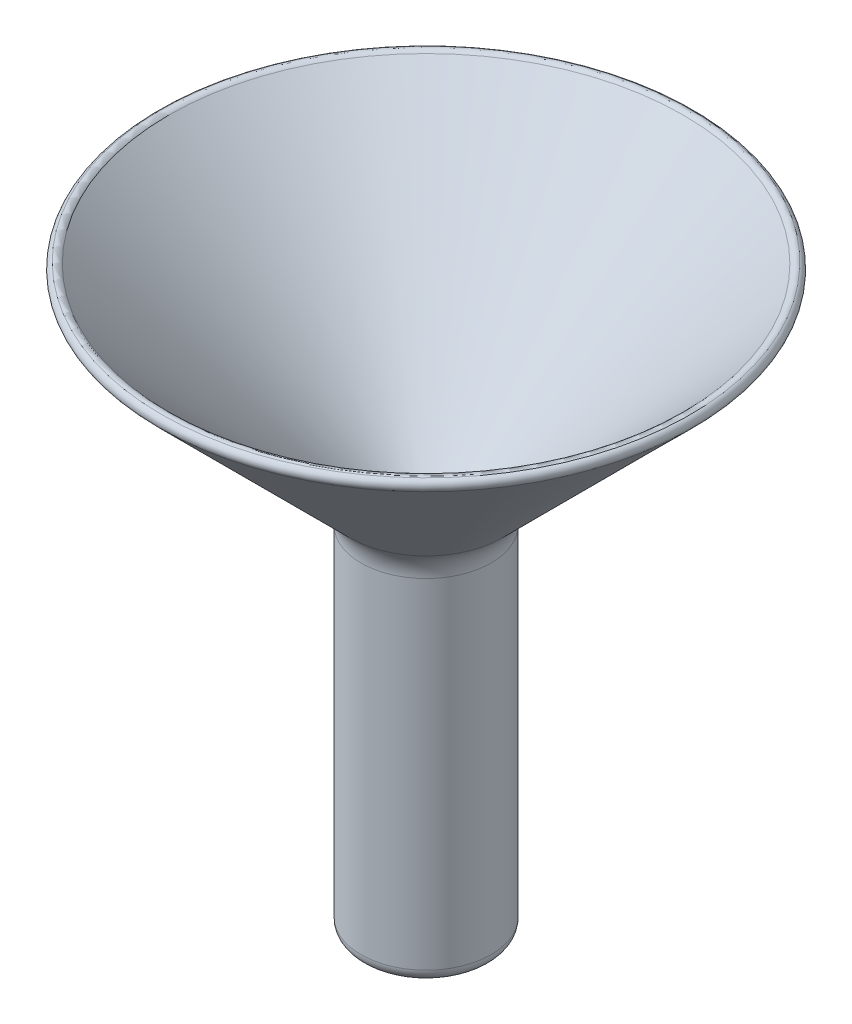
ISO-10303-21;
HEADER;
FILE_DESCRIPTION(('STEP AP214'),'2;1');
FILE_NAME('part.step','',(''),(''),'','','');
FILE_SCHEMA(('AUTOMOTIVE_DESIGN { 1 0 10303 214 1 1 1 1 }'));
ENDSEC;
DATA;
#1=APPLICATION_CONTEXT('core data for automotive mechanical design processes');
#2=APPLICATION_PROTOCOL_DEFINITION('international standard','automotive_design',2000,#1);
#3=PRODUCT_CONTEXT('',#1,'mechanical');
#4=PRODUCT('Part','Part','',(#3));
#5=PRODUCT_RELATED_PRODUCT_CATEGORY('part','',(#4));
#6=PRODUCT_DEFINITION_FORMATION('','',#4);
#7=PRODUCT_DEFINITION_CONTEXT('part definition',#1,'design');
#8=PRODUCT_DEFINITION('design','',#6,#7);
#9=PRODUCT_DEFINITION_SHAPE('','',#8);
#10=(LENGTH_UNIT() NAMED_UNIT(*) SI_UNIT(.MILLI.,.METRE.));
#11=(NAMED_UNIT(*) PLANE_ANGLE_UNIT() SI_UNIT($,.RADIAN.));
#12=(NAMED_UNIT(*) SI_UNIT($,.STERADIAN.) SOLID_ANGLE_UNIT());
#13=UNCERTAINTY_MEASURE_WITH_UNIT(LENGTH_MEASURE(1.E-05),#10,'distance_accuracy_value','');
#14=(GEOMETRIC_REPRESENTATION_CONTEXT(3) GLOBAL_UNCERTAINTY_ASSIGNED_CONTEXT((#13)) GLOBAL_UNIT_ASSIGNED_CONTEXT((#10,
#11,#12)) REPRESENTATION_CONTEXT('',''));
#15=CARTESIAN_POINT('',(0.,0.,0.));
#16=DIRECTION('',(0.,0.,1.));
#17=DIRECTION('',(1.,0.,0.));
#18=AXIS2_PLACEMENT_3D('',#15,#16,#17);
#19=CARTESIAN_POINT('',(0.,0.,0.));
#20=DIRECTION('',(0.,-1.,0.));
#21=DIRECTION('',(0.,0.,-1.));
#22=AXIS2_PLACEMENT_3D('',#19,#20,#21);
#23=CYLINDRICAL_SURFACE('',#22,5.);
#24=CARTESIAN_POINT('',(0.,-11.,0.));
#25=DIRECTION('',(0.,-1.,0.));
#26=DIRECTION('',(0.,0.,-1.));
#27=AXIS2_PLACEMENT_3D('',#24,#25,#26);
#28=CIRCLE('',#27,5.);
#29=CARTESIAN_POINT('',(0.,-11.,-5.));
#30=VERTEX_POINT('',#29);
#31=EDGE_CURVE('E53',#30,#30,#28,.F.);
#32=ORIENTED_EDGE('',*,*,#31,.T.);
#33=EDGE_LOOP('',(#32));
#34=FACE_BOUND('',#33,.T.);
#35=CARTESIAN_POINT('',(0.,15.0573593128807,0.));
#36=DIRECTION('',(0.,-1.,0.));
#37=DIRECTION('',(0.,0.,-1.));
#38=AXIS2_PLACEMENT_3D('',#35,#36,#37);
#39=CIRCLE('',#38,5.);
#40=CARTESIAN_POINT('',(0.,15.0573593128807,-5.));
#41=VERTEX_POINT('',#40);
#42=EDGE_CURVE('E59',#41,#41,#39,.T.);
#43=ORIENTED_EDGE('',*,*,#42,.T.);
#44=EDGE_LOOP('',(#43));
#45=FACE_BOUND('',#44,.T.);
#46=ADVANCED_FACE('F33',(#34,#45),#23,.T.);
#47=CARTESIAN_POINT('',(0.,15.0573593128807,0.));
#48=DIRECTION('',(0.,-1.,0.));
#49=DIRECTION('',(0.,0.,-1.));
#50=AXIS2_PLACEMENT_3D('',#47,#48,#49);
#51=TOROIDAL_SURFACE('',#50,8.,3.);
#52=CARTESIAN_POINT('',(0.,17.1786796564404,0.));
#53=DIRECTION('',(0.,-1.,0.));
#54=DIRECTION('',(0.,0.,-1.));
#55=AXIS2_PLACEMENT_3D('',#52,#53,#54);
#56=CIRCLE('',#55,5.87867965644037);
#57=CARTESIAN_POINT('',(0.,17.1786796564404,5.87867965644037));
#58=VERTEX_POINT('',#57);
#59=EDGE_CURVE('E62',#58,#58,#56,.T.);
#60=ORIENTED_EDGE('',*,*,#59,.T.);
#61=EDGE_LOOP('',(#60));
#62=FACE_BOUND('',#61,.T.);
#63=ORIENTED_EDGE('',*,*,#42,.F.);
#64=EDGE_LOOP('',(#63));
#65=FACE_BOUND('',#64,.T.);
#66=ADVANCED_FACE('F119',(#62,#65),#51,.F.);
#67=CARTESIAN_POINT('',(0.,17.1786796564404,0.));
#68=DIRECTION('',(0.,1.,0.));
#69=DIRECTION('',(0.,0.,1.));
#70=AXIS2_PLACEMENT_3D('',#67,#68,#69);
#71=CONICAL_SURFACE('',#70,5.87867965644037,0.78539816339745);
#72=CARTESIAN_POINT('',(0.,31.7708699582281,0.));
#73=DIRECTION('',(0.,1.,0.));
#74=DIRECTION('',(0.,0.,1.));
#75=AXIS2_PLACEMENT_3D('',#72,#73,#74);
#76=CIRCLE('',#75,20.4708699582282);
#77=CARTESIAN_POINT('',(0.,31.7708699582281,20.4708699582282));
#78=VERTEX_POINT('',#77);
#79=EDGE_CURVE('E41',#78,#78,#76,.F.);
#80=CARTESIAN_POINT('',(0.,31.7708699582281,20.4708699582282));
#81=CARTESIAN_POINT('',(0.,31.6188679759178,20.3188679759179));
#82=CARTESIAN_POINT('',(0.,31.4668659936075,20.1668659936076));
#83=CARTESIAN_POINT('',(0.,31.162862028987,19.862862028987));
#84=CARTESIAN_POINT('',(0.,31.0108600466767,19.7108600466767));
#85=CARTESIAN_POINT('',(0.,30.7068560820561,19.4068560820561));
#86=CARTESIAN_POINT('',(0.,30.5548540997458,19.2548540997459));
#87=CARTESIAN_POINT('',(0.,30.2508501351252,18.9508501351253));
#88=CARTESIAN_POINT('',(0.,30.0988481528149,18.798848152815));
#89=CARTESIAN_POINT('',(0.,29.7948441881944,18.4948441881944));
#90=CARTESIAN_POINT('',(0.,29.6428422058841,18.3428422058841));
#91=CARTESIAN_POINT('',(0.,29.3388382412635,18.0388382412635));
#92=CARTESIAN_POINT('',(0.,29.1868362589532,17.8868362589532));
#93=CARTESIAN_POINT('',(0.,28.8828322943326,17.5828322943327));
#94=CARTESIAN_POINT('',(0.,28.7308303120223,17.4308303120224));
#95=CARTESIAN_POINT('',(0.,28.4268263474018,17.1268263474018));
#96=CARTESIAN_POINT('',(0.,28.2748243650915,16.9748243650915));
#97=CARTESIAN_POINT('',(0.,27.9708204004709,16.6708204004709));
#98=CARTESIAN_POINT('',(0.,27.8188184181606,16.5188184181606));
#99=CARTESIAN_POINT('',(0.,27.51481445354,16.2148144535401));
#100=CARTESIAN_POINT('',(0.,27.3628124712297,16.0628124712298));
#101=CARTESIAN_POINT('',(0.,27.0588085066092,15.7588085066092));
#102=CARTESIAN_POINT('',(0.,26.9068065242989,15.6068065242989));
#103=CARTESIAN_POINT('',(0.,26.6028025596783,15.3028025596783));
#104=CARTESIAN_POINT('',(0.,26.450800577368,15.150800577368));
#105=CARTESIAN_POINT('',(0.,26.1467966127474,14.8467966127475));
#106=CARTESIAN_POINT('',(0.,25.9947946304371,14.6947946304372));
#107=CARTESIAN_POINT('',(0.,25.6907906658166,14.3907906658166));
#108=CARTESIAN_POINT('',(0.,25.5387886835063,14.2387886835063));
#109=CARTESIAN_POINT('',(0.,25.2347847188857,13.9347847188857));
#110=CARTESIAN_POINT('',(0.,25.0827827365754,13.7827827365754));
#111=CARTESIAN_POINT('',(0.,24.7787787719548,13.4787787719548));
#112=CARTESIAN_POINT('',(0.,24.6267767896445,13.3267767896446));
#113=CARTESIAN_POINT('',(0.,24.322772825024,13.022772825024));
#114=CARTESIAN_POINT('',(0.,24.1707708427137,12.8707708427137));
#115=CARTESIAN_POINT('',(0.,23.8667668780931,12.5667668780931));
#116=CARTESIAN_POINT('',(0.,23.7147648957828,12.4147648957828));
#117=CARTESIAN_POINT('',(0.,23.4107609311622,12.1107609311622));
#118=CARTESIAN_POINT('',(0.,23.2587589488519,11.9587589488519));
#119=CARTESIAN_POINT('',(0.,22.9547549842314,11.6547549842314));
#120=CARTESIAN_POINT('',(0.,22.8027530019211,11.5027530019211));
#121=CARTESIAN_POINT('',(0.,22.4987490373005,11.1987490373005));
#122=CARTESIAN_POINT('',(0.,22.3467470549902,11.0467470549902));
#123=CARTESIAN_POINT('',(0.,22.0427430903696,10.7427430903696));
#124=CARTESIAN_POINT('',(0.,21.8907411080593,10.5907411080593));
#125=CARTESIAN_POINT('',(0.,21.5867371434388,10.2867371434388));
#126=CARTESIAN_POINT('',(0.,21.4347351611285,10.1347351611285));
#127=CARTESIAN_POINT('',(0.,21.1307311965079,9.8307311965079));
#128=CARTESIAN_POINT('',(0.,20.9787292141976,9.67872921419761));
#129=CARTESIAN_POINT('',(0.,20.674725249577,9.37472524957703));
#130=CARTESIAN_POINT('',(0.,20.5227232672667,9.22272326726674));
#131=CARTESIAN_POINT('',(0.,20.2187193026462,8.91871930264616));
#132=CARTESIAN_POINT('',(0.,20.0667173203359,8.76671732033587));
#133=CARTESIAN_POINT('',(0.,19.7627133557153,8.46271335571529));
#134=CARTESIAN_POINT('',(0.,19.610711373405,8.310711373405));
#135=CARTESIAN_POINT('',(0.,19.3067074087844,8.00670740878442));
#136=CARTESIAN_POINT('',(0.,19.1547054264741,7.85470542647413));
#137=CARTESIAN_POINT('',(0.,18.8507014618536,7.55070146185355));
#138=CARTESIAN_POINT('',(0.,18.6986994795433,7.39869947954326));
#139=CARTESIAN_POINT('',(0.,18.3946955149227,7.09469551492268));
#140=CARTESIAN_POINT('',(0.,18.2426935326124,6.94269353261239));
#141=CARTESIAN_POINT('',(0.,17.9386895679918,6.63868956799181));
#142=CARTESIAN_POINT('',(0.,17.7866875856815,6.48668758568153));
#143=CARTESIAN_POINT('',(0.,17.482683621061,6.18268362106095));
#144=CARTESIAN_POINT('',(0.,17.3306816387507,6.03068163875066));
#145=CARTESIAN_POINT('',(0.,17.1786796564404,5.87867965644037));
#146=B_SPLINE_CURVE_WITH_KNOTS('',3,(#80,#81,#82,#83,#84,#85,#86,#87,#88,#89,#90,#91,#92,#93,
#94,#95,#96,#97,#98,#99,#100,#101,#102,#103,#104,#105,#106,#107,#108,#109,#110,#111,#112,#113,
#114,#115,#116,#117,#118,#119,#120,#121,#122,#123,#124,#125,#126,#127,#128,#129,#130,#131,#132,
#133,#134,#135,#136,#137,#138,#139,#140,#141,#142,#143,#144,#145),.UNSPECIFIED.,.F.,.F.,(4,2,2,
2,2,2,2,2,2,2,2,2,2,2,2,2,2,2,2,2,2,2,2,2,2,2,2,2,2,2,2,2,4),(0.,0.644889794672421,
1.28977958934484,1.93466938401726,2.57955917868968,3.2244489733621,3.86933876803452,
4.51422856270694,5.15911835737936,5.80400815205178,6.44889794672419,7.09378774139662,
7.73867753606903,8.38356733074146,9.02845712541387,9.67334692008629,10.3182367147587,
10.9631265094311,11.6080163041036,12.252906098776,12.8977958934484,13.5426856881208,
14.1875754827932,14.8324652774656,15.4773550721381,16.1222448668105,16.7671346614829,
17.4120244561553,18.0569142508277,18.7018040455002,19.3466938401726,19.991583634845,
20.6364734295174),.UNSPECIFIED.);
#147=EDGE_CURVE('BSEAM125',#78,#58,#146,.T.);
#148=ORIENTED_EDGE('',*,*,#79,.T.);
#149=ORIENTED_EDGE('',*,*,#59,.F.);
#150=ORIENTED_EDGE('',*,*,#147,.T.);
#151=ORIENTED_EDGE('',*,*,#147,.F.);
#152=EDGE_LOOP('',(#148,#150,#149,#151));
#153=FACE_BOUND('',#152,.T.);
#154=ADVANCED_FACE('F125',(#153),#71,.T.);
#155=CARTESIAN_POINT('',(0.,14.8142135623731,0.));
#156=DIRECTION('',(0.,1.,0.));
#157=DIRECTION('',(0.,0.,1.));
#158=AXIS2_PLACEMENT_3D('',#155,#156,#157);
#159=CONICAL_SURFACE('',#158,2.1,0.78539816339745);
#160=CARTESIAN_POINT('',(0.,32.4779767394147,0.));
#161=DIRECTION('',(0.,-1.,0.));
#162=DIRECTION('',(0.,0.,-1.));
#163=AXIS2_PLACEMENT_3D('',#160,#161,#162);
#164=CIRCLE('',#163,19.7637631770416);
#165=CARTESIAN_POINT('',(0.,32.4779767394147,19.7637631770416));
#166=VERTEX_POINT('',#165);
#167=EDGE_CURVE('E10',#166,#166,#164,.F.);
#168=CARTESIAN_POINT('',(0.,15.1071067811866,0.));
#169=DIRECTION('',(0.,1.,0.));
#170=DIRECTION('',(0.,0.,1.));
#171=AXIS2_PLACEMENT_3D('',#168,#169,#170);
#172=CIRCLE('',#171,2.39289321881345);
#173=CARTESIAN_POINT('',(0.,15.1071067811866,2.39289321881345));
#174=VERTEX_POINT('',#173);
#175=EDGE_CURVE('E50',#174,#174,#172,.F.);
#176=CARTESIAN_POINT('',(0.,32.4779767394147,19.7637631770416));
#177=CARTESIAN_POINT('',(0.,32.2970301773498,19.5828166149768));
#178=CARTESIAN_POINT('',(0.,32.1160836152849,19.4018700529119));
#179=CARTESIAN_POINT('',(0.,31.7541904911552,19.0399769287821));
#180=CARTESIAN_POINT('',(0.,31.5732439290903,18.8590303667173));
#181=CARTESIAN_POINT('',(0.,31.2113508049606,18.4971372425875));
#182=CARTESIAN_POINT('',(0.,31.0304042428957,18.3161906805226));
#183=CARTESIAN_POINT('',(0.,30.6685111187659,17.9542975563929));
#184=CARTESIAN_POINT('',(0.,30.4875645567011,17.773350994328));
#185=CARTESIAN_POINT('',(0.,30.1256714325713,17.4114578701982));
#186=CARTESIAN_POINT('',(0.,29.9447248705064,17.2305113081334));
#187=CARTESIAN_POINT('',(0.,29.5828317463767,16.8686181840036));
#188=CARTESIAN_POINT('',(0.,29.4018851843118,16.6876716219387));
#189=CARTESIAN_POINT('',(0.,29.039992060182,16.325778497809));
#190=CARTESIAN_POINT('',(0.,28.8590454981172,16.1448319357441));
#191=CARTESIAN_POINT('',(0.,28.4971523739874,15.7829388116143));
#192=CARTESIAN_POINT('',(0.,28.3162058119225,15.6019922495495));
#193=CARTESIAN_POINT('',(0.,27.9543126877928,15.2400991254197));
#194=CARTESIAN_POINT('',(0.,27.7733661257279,15.0591525633548));
#195=CARTESIAN_POINT('',(0.,27.4114730015982,14.6972594392251));
#196=CARTESIAN_POINT('',(0.,27.2305264395333,14.5163128771602));
#197=CARTESIAN_POINT('',(0.,26.8686333154035,14.1544197530305));
#198=CARTESIAN_POINT('',(0.,26.6876867533386,13.9734731909656));
#199=CARTESIAN_POINT('',(0.,26.3257936292089,13.6115800668358));
#200=CARTESIAN_POINT('',(0.,26.144847067144,13.4306335047709));
#201=CARTESIAN_POINT('',(0.,25.7829539430143,13.0687403806412));
#202=CARTESIAN_POINT('',(0.,25.6020073809494,12.8877938185763));
#203=CARTESIAN_POINT('',(0.,25.2401142568196,12.5259006944466));
#204=CARTESIAN_POINT('',(0.,25.0591676947548,12.3449541323817));
#205=CARTESIAN_POINT('',(0.,24.697274570625,11.9830610082519));
#206=CARTESIAN_POINT('',(0.,24.5163280085601,11.8021144461871));
#207=CARTESIAN_POINT('',(0.,24.1544348844304,11.4402213220573));
#208=CARTESIAN_POINT('',(0.,23.9734883223655,11.2592747599924));
#209=CARTESIAN_POINT('',(0.,23.6115951982358,10.8973816358627));
#210=CARTESIAN_POINT('',(0.,23.4306486361709,10.7164350737978));
#211=CARTESIAN_POINT('',(0.,23.0687555120411,10.354541949668));
#212=CARTESIAN_POINT('',(0.,22.8878089499762,10.1735953876032));
#213=CARTESIAN_POINT('',(0.,22.5259158258465,9.81170226347341));
#214=CARTESIAN_POINT('',(0.,22.3449692637816,9.63075570140853));
#215=CARTESIAN_POINT('',(0.,21.9830761396519,9.26886257727878));
#216=CARTESIAN_POINT('',(0.,21.802129577587,9.0879160152139));
#217=CARTESIAN_POINT('',(0.,21.4402364534572,8.72602289108415));
#218=CARTESIAN_POINT('',(0.,21.2592898913924,8.54507632901927));
#219=CARTESIAN_POINT('',(0.,20.8973967672626,8.18318320488951));
#220=CARTESIAN_POINT('',(0.,20.7164502051977,8.00223664282464));
#221=CARTESIAN_POINT('',(0.,20.354557081068,7.64034351869489));
#222=CARTESIAN_POINT('',(0.,20.1736105190031,7.45939695663001));
#223=CARTESIAN_POINT('',(0.,19.8117173948733,7.09750383250025));
#224=CARTESIAN_POINT('',(0.,19.6307708328085,6.91655727043538));
#225=CARTESIAN_POINT('',(0.,19.2688777086787,6.55466414630562));
#226=CARTESIAN_POINT('',(0.,19.0879311466138,6.37371758424075));
#227=CARTESIAN_POINT('',(0.,18.7260380224841,6.01182446011099));
#228=CARTESIAN_POINT('',(0.,18.5450914604192,5.83087789804611));
#229=CARTESIAN_POINT('',(0.,18.1831983362895,5.46898477391636));
#230=CARTESIAN_POINT('',(0.,18.0022517742246,5.28803821185148));
#231=CARTESIAN_POINT('',(0.,17.6403586500948,4.92614508772173));
#232=CARTESIAN_POINT('',(0.,17.45941208803,4.74519852565685));
#233=CARTESIAN_POINT('',(0.,17.0975189639002,4.3833054015271));
#234=CARTESIAN_POINT('',(0.,16.9165724018353,4.20235883946222));
#235=CARTESIAN_POINT('',(0.,16.5546792777056,3.84046571533247));
#236=CARTESIAN_POINT('',(0.,16.3737327156407,3.65951915326759));
#237=CARTESIAN_POINT('',(0.,16.0118395915109,3.29762602913783));
#238=CARTESIAN_POINT('',(0.,15.8308930294461,3.11667946707296));
#239=CARTESIAN_POINT('',(0.,15.4689999053163,2.75478634294321));
#240=CARTESIAN_POINT('',(0.,15.2880533432514,2.57383978087833));
#241=CARTESIAN_POINT('',(0.,15.1071067811866,2.39289321881345));
#242=B_SPLINE_CURVE_WITH_KNOTS('',3,(#176,#177,#178,#179,#180,#181,#182,#183,#184,#185,#186,
#187,#188,#189,#190,#191,#192,#193,#194,#195,#196,#197,#198,#199,#200,#201,#202,#203,#204,#205,
#206,#207,#208,#209,#210,#211,#212,#213,#214,#215,#216,#217,#218,#219,#220,#221,#222,#223,#224,
#225,#226,#227,#228,#229,#230,#231,#232,#233,#234,#235,#236,#237,#238,#239,#240,#241),
.UNSPECIFIED.,.F.,.F.,(4,2,2,2,2,2,2,2,2,2,2,2,2,2,2,2,2,2,2,2,2,2,2,2,2,2,2,2,2,2,2,2,4),(0.,
0.767691246410796,1.5353824928216,2.3030737392324,3.0707649856432,3.838456232054,
4.6061474784648,5.3738387248756,6.1415299712864,6.90922121769721,7.67691246410801,
8.44460371051881,9.2122949569296,9.97998620334041,10.7476774497512,11.515368696162,
12.2830599425728,13.0507511889836,13.8184424353944,14.5861336818052,15.353824928216,
16.1215161746268,16.8892074210376,17.6568986674484,18.4245899138592,19.19228116027,
19.9599724066808,20.7276636530916,21.4953548995024,22.2630461459132,23.030737392324,
23.7984286387348,24.5661198851456),.UNSPECIFIED.);
#243=EDGE_CURVE('BSEAM192',#166,#174,#242,.T.);
#244=ORIENTED_EDGE('',*,*,#167,.T.);
#245=ORIENTED_EDGE('',*,*,#175,.T.);
#246=ORIENTED_EDGE('',*,*,#243,.T.);
#247=ORIENTED_EDGE('',*,*,#243,.F.);
#248=EDGE_LOOP('',(#244,#246,#245,#247));
#249=FACE_BOUND('',#248,.T.);
#250=ADVANCED_FACE('F192',(#249),#159,.F.);
#251=CARTESIAN_POINT('',(0.,0.,0.));
#252=DIRECTION('',(0.,-1.,0.));
#253=DIRECTION('',(0.,0.,-1.));
#254=AXIS2_PLACEMENT_3D('',#251,#252,#253);
#255=CYLINDRICAL_SURFACE('',#254,2.1);
#256=CARTESIAN_POINT('',(0.,14.4,0.));
#257=DIRECTION('',(0.,1.,0.));
#258=DIRECTION('',(0.,0.,1.));
#259=AXIS2_PLACEMENT_3D('',#256,#257,#258);
#260=CIRCLE('',#259,2.1);
#261=CARTESIAN_POINT('',(0.,14.4,2.1));
#262=VERTEX_POINT('',#261);
#263=EDGE_CURVE('E45',#262,#262,#260,.T.);
#264=ORIENTED_EDGE('',*,*,#263,.T.);
#265=EDGE_LOOP('',(#264));
#266=FACE_BOUND('',#265,.T.);
#267=CARTESIAN_POINT('',(0.,-5.,0.));
#268=DIRECTION('',(0.,-1.,0.));
#269=DIRECTION('',(0.,0.,-1.));
#270=AXIS2_PLACEMENT_3D('',#267,#268,#269);
#271=CIRCLE('',#270,2.1);
#272=CARTESIAN_POINT('',(0.,-5.,-2.1));
#273=VERTEX_POINT('',#272);
#274=EDGE_CURVE('E65',#273,#273,#271,.T.);
#275=ORIENTED_EDGE('',*,*,#274,.T.);
#276=EDGE_LOOP('',(#275));
#277=FACE_BOUND('',#276,.T.);
#278=ADVANCED_FACE('F188',(#266,#277),#255,.F.);
#279=CARTESIAN_POINT('',(0.,-3.,0.));
#280=DIRECTION('',(0.,-1.,0.));
#281=DIRECTION('',(1.,0.,0.));
#282=AXIS2_PLACEMENT_3D('',#279,#280,#281);
#283=SPHERICAL_SURFACE('',#282,2.9);
#284=ORIENTED_EDGE('',*,*,#274,.F.);
#285=EDGE_LOOP('',(#284));
#286=FACE_BOUND('',#285,.T.);
#287=CARTESIAN_POINT('',(0.,-3.,0.));
#288=DIRECTION('',(0.,-1.,0.));
#289=DIRECTION('',(0.,0.,-1.));
#290=AXIS2_PLACEMENT_3D('',#287,#288,#289);
#291=CIRCLE('',#290,2.9);
#292=CARTESIAN_POINT('',(0.,-3.,-2.9));
#293=VERTEX_POINT('',#292);
#294=EDGE_CURVE('E68',#293,#293,#291,.T.);
#295=ORIENTED_EDGE('',*,*,#294,.T.);
#296=EDGE_LOOP('',(#295));
#297=FACE_BOUND('',#296,.T.);
#298=ADVANCED_FACE('F184',(#286,#297),#283,.T.);
#299=CARTESIAN_POINT('',(0.,0.,0.));
#300=DIRECTION('',(0.,-1.,0.));
#301=DIRECTION('',(0.,0.,-1.));
#302=AXIS2_PLACEMENT_3D('',#299,#300,#301);
#303=CYLINDRICAL_SURFACE('',#302,2.9);
#304=CARTESIAN_POINT('',(0.,5.,0.));
#305=DIRECTION('',(0.,-1.,0.));
#306=DIRECTION('',(0.,0.,-1.));
#307=AXIS2_PLACEMENT_3D('',#304,#305,#306);
#308=CIRCLE('',#307,2.9);
#309=CARTESIAN_POINT('',(0.,5.,-2.9));
#310=VERTEX_POINT('',#309);
#311=EDGE_CURVE('E71',#310,#310,#308,.T.);
#312=ORIENTED_EDGE('',*,*,#311,.T.);
#313=EDGE_LOOP('',(#312));
#314=FACE_BOUND('',#313,.T.);
#315=ORIENTED_EDGE('',*,*,#294,.F.);
#316=EDGE_LOOP('',(#315));
#317=FACE_BOUND('',#316,.T.);
#318=ADVANCED_FACE('F180',(#314,#317),#303,.T.);
#319=CARTESIAN_POINT('',(0.,5.,0.));
#320=DIRECTION('',(0.,-1.,0.));
#321=DIRECTION('',(0.,0.,-1.));
#322=AXIS2_PLACEMENT_3D('',#319,#320,#321);
#323=TOROIDAL_SURFACE('',#322,3.7,0.8);
#324=CARTESIAN_POINT('',(0.,5.04995121951219,0.));
#325=DIRECTION('',(0.,-1.,0.));
#326=DIRECTION('',(0.,0.,-1.));
#327=AXIS2_PLACEMENT_3D('',#324,#325,#326);
#328=CIRCLE('',#327,2.90156097560976);
#329=CARTESIAN_POINT('',(0.,5.04995121951219,-2.90156097560976));
#330=VERTEX_POINT('',#329);
#331=EDGE_CURVE('E74',#330,#330,#328,.T.);
#332=ORIENTED_EDGE('',*,*,#331,.T.);
#333=EDGE_LOOP('',(#332));
#334=FACE_BOUND('',#333,.T.);
#335=ORIENTED_EDGE('',*,*,#311,.F.);
#336=EDGE_LOOP('',(#335));
#337=FACE_BOUND('',#336,.T.);
#338=ADVANCED_FACE('F176',(#334,#337),#323,.F.);
#339=CARTESIAN_POINT('',(0.,11.4,0.));
#340=DIRECTION('',(0.,1.,0.));
#341=DIRECTION('',(0.,0.,1.));
#342=AXIS2_PLACEMENT_3D('',#339,#340,#341);
#343=CONICAL_SURFACE('',#342,3.1,0.0312398334302685);
#344=ORIENTED_EDGE('',*,*,#331,.F.);
#345=EDGE_LOOP('',(#344));
#346=FACE_BOUND('',#345,.T.);
#347=CARTESIAN_POINT('',(0.,11.4,0.));
#348=DIRECTION('',(0.,-1.,0.));
#349=DIRECTION('',(0.,0.,-1.));
#350=AXIS2_PLACEMENT_3D('',#347,#348,#349);
#351=CIRCLE('',#350,3.1);
#352=CARTESIAN_POINT('',(0.,11.4,-3.1));
#353=VERTEX_POINT('',#352);
#354=EDGE_CURVE('E77',#353,#353,#351,.T.);
#355=ORIENTED_EDGE('',*,*,#354,.T.);
#356=EDGE_LOOP('',(#355));
#357=FACE_BOUND('',#356,.T.);
#358=ADVANCED_FACE('F172',(#346,#357),#343,.T.);
#359=CARTESIAN_POINT('',(0.,0.,0.));
#360=DIRECTION('',(0.,-1.,0.));
#361=DIRECTION('',(0.,0.,-1.));
#362=AXIS2_PLACEMENT_3D('',#359,#360,#361);
#363=CYLINDRICAL_SURFACE('',#362,3.1);
#364=ORIENTED_EDGE('',*,*,#354,.F.);
#365=EDGE_LOOP('',(#364));
#366=FACE_BOUND('',#365,.T.);
#367=CARTESIAN_POINT('',(0.,14.4,0.));
#368=DIRECTION('',(0.,-1.,0.));
#369=DIRECTION('',(0.,0.,-1.));
#370=AXIS2_PLACEMENT_3D('',#367,#368,#369);
#371=CIRCLE('',#370,3.09999999999999);
#372=CARTESIAN_POINT('',(0.,14.4,-3.09999999999999));
#373=VERTEX_POINT('',#372);
#374=EDGE_CURVE('E80',#373,#373,#371,.T.);
#375=ORIENTED_EDGE('',*,*,#374,.T.);
#376=EDGE_LOOP('',(#375));
#377=FACE_BOUND('',#376,.T.);
#378=ADVANCED_FACE('F168',(#366,#377),#363,.T.);
#379=CARTESIAN_POINT('',(0.,15.,0.));
#380=DIRECTION('',(0.,1.,0.));
#381=DIRECTION('',(0.,0.,1.));
#382=AXIS2_PLACEMENT_3D('',#379,#380,#381);
#383=CONICAL_SURFACE('',#382,3.7,0.785398163397448);
#384=ORIENTED_EDGE('',*,*,#374,.F.);
#385=EDGE_LOOP('',(#384));
#386=FACE_BOUND('',#385,.T.);
#387=CARTESIAN_POINT('',(0.,15.,0.));
#388=DIRECTION('',(0.,-1.,0.));
#389=DIRECTION('',(0.,0.,-1.));
#390=AXIS2_PLACEMENT_3D('',#387,#388,#389);
#391=CIRCLE('',#390,3.7);
#392=CARTESIAN_POINT('',(0.,15.,-3.7));
#393=VERTEX_POINT('',#392);
#394=EDGE_CURVE('E83',#393,#393,#391,.T.);
#395=ORIENTED_EDGE('',*,*,#394,.T.);
#396=EDGE_LOOP('',(#395));
#397=FACE_BOUND('',#396,.T.);
#398=ADVANCED_FACE('F164',(#386,#397),#383,.T.);
#399=CARTESIAN_POINT('',(0.,0.,0.));
#400=DIRECTION('',(0.,-1.,0.));
#401=DIRECTION('',(0.,0.,-1.));
#402=AXIS2_PLACEMENT_3D('',#399,#400,#401);
#403=CYLINDRICAL_SURFACE('',#402,3.7);
#404=ORIENTED_EDGE('',*,*,#394,.F.);
#405=EDGE_LOOP('',(#404));
#406=FACE_BOUND('',#405,.T.);
#407=CARTESIAN_POINT('',(0.,-2.91485321018865,0.));
#408=DIRECTION('',(0.,-1.,0.));
#409=DIRECTION('',(0.,0.,-1.));
#410=AXIS2_PLACEMENT_3D('',#407,#408,#409);
#411=CIRCLE('',#410,3.7);
#412=CARTESIAN_POINT('',(0.,-2.91485321018865,-3.7));
#413=VERTEX_POINT('',#412);
#414=EDGE_CURVE('E86',#413,#413,#411,.T.);
#415=ORIENTED_EDGE('',*,*,#414,.T.);
#416=EDGE_LOOP('',(#415));
#417=FACE_BOUND('',#416,.T.);
#418=ADVANCED_FACE('F160',(#406,#417),#403,.F.);
#419=CARTESIAN_POINT('',(0.,-2.91485321018866,0.));
#420=DIRECTION('',(0.,-1.,0.));
#421=DIRECTION('',(0.,0.,-1.));
#422=AXIS2_PLACEMENT_3D('',#419,#420,#421);
#423=DEGENERATE_TOROIDAL_SURFACE('',#422,1.3,5.,.F.);
#424=ORIENTED_EDGE('',*,*,#414,.F.);
#425=EDGE_LOOP('',(#424));
#426=FACE_BOUND('',#425,.T.);
#427=CARTESIAN_POINT('',(0.,-4.98752054720073,0.));
#428=DIRECTION('',(0.,-1.,0.));
#429=DIRECTION('',(0.,0.,-1.));
#430=AXIS2_PLACEMENT_3D('',#427,#428,#429);
#431=CIRCLE('',#430,3.25017033857891);
#432=CARTESIAN_POINT('',(0.,-4.98752054720073,-3.25017033857891));
#433=VERTEX_POINT('',#432);
#434=EDGE_CURVE('E89',#433,#433,#431,.T.);
#435=ORIENTED_EDGE('',*,*,#434,.T.);
#436=EDGE_LOOP('',(#435));
#437=FACE_BOUND('',#436,.T.);
#438=ADVANCED_FACE('F156',(#426,#437),#423,.T.);
#439=CARTESIAN_POINT('',(0.,-4.98752054720073,0.));
#440=DIRECTION('',(0.,1.,0.));
#441=DIRECTION('',(0.,0.,1.));
#442=AXIS2_PLACEMENT_3D('',#439,#440,#441);
#443=CONICAL_SURFACE('',#442,3.25017033857891,0.427430089087367);
#444=CARTESIAN_POINT('',(0.,-5.42733266298792,0.));
#445=DIRECTION('',(0.,-1.,0.));
#446=DIRECTION('',(0.,0.,-1.));
#447=AXIS2_PLACEMENT_3D('',#444,#445,#446);
#448=CIRCLE('',#447,3.0498296614211);
#449=CARTESIAN_POINT('',(0.,-5.42733266298792,-3.0498296614211));
#450=VERTEX_POINT('',#449);
#451=EDGE_CURVE('E92',#450,#450,#448,.T.);
#452=ORIENTED_EDGE('',*,*,#451,.T.);
#453=EDGE_LOOP('',(#452));
#454=FACE_BOUND('',#453,.T.);
#455=ORIENTED_EDGE('',*,*,#434,.F.);
#456=EDGE_LOOP('',(#455));
#457=FACE_BOUND('',#456,.T.);
#458=ADVANCED_FACE('F152',(#454,#457),#443,.F.);
#459=CARTESIAN_POINT('',(0.,-7.5,0.));
#460=DIRECTION('',(0.,-1.,0.));
#461=DIRECTION('',(0.,0.,-1.));
#462=AXIS2_PLACEMENT_3D('',#459,#460,#461);
#463=TOROIDAL_SURFACE('',#462,7.6,5.);
#464=ORIENTED_EDGE('',*,*,#451,.F.);
#465=EDGE_LOOP('',(#464));
#466=FACE_BOUND('',#465,.T.);
#467=CARTESIAN_POINT('',(0.,-7.5,0.));
#468=DIRECTION('',(0.,-1.,0.));
#469=DIRECTION('',(0.,0.,-1.));
#470=AXIS2_PLACEMENT_3D('',#467,#468,#469);
#471=CIRCLE('',#470,2.6);
#472=CARTESIAN_POINT('',(0.,-7.5,-2.6));
#473=VERTEX_POINT('',#472);
#474=EDGE_CURVE('E95',#473,#473,#471,.T.);
#475=ORIENTED_EDGE('',*,*,#474,.T.);
#476=EDGE_LOOP('',(#475));
#477=FACE_BOUND('',#476,.T.);
#478=ADVANCED_FACE('F147',(#466,#477),#463,.T.);
#479=CARTESIAN_POINT('',(0.,0.,0.));
#480=DIRECTION('',(0.,-1.,0.));
#481=DIRECTION('',(0.,0.,-1.));
#482=AXIS2_PLACEMENT_3D('',#479,#480,#481);
#483=CYLINDRICAL_SURFACE('',#482,2.6);
#484=CARTESIAN_POINT('',(0.,-12.,0.));
#485=DIRECTION('',(0.,-1.,0.));
#486=DIRECTION('',(0.,0.,-1.));
#487=AXIS2_PLACEMENT_3D('',#484,#485,#486);
#488=CIRCLE('',#487,2.6);
#489=CARTESIAN_POINT('',(0.,-12.,-2.6));
#490=VERTEX_POINT('',#489);
#491=EDGE_CURVE('E98',#490,#490,#488,.T.);
#492=ORIENTED_EDGE('',*,*,#491,.T.);
#493=EDGE_LOOP('',(#492));
#494=FACE_BOUND('',#493,.T.);
#495=ORIENTED_EDGE('',*,*,#474,.F.);
#496=EDGE_LOOP('',(#495));
#497=FACE_BOUND('',#496,.T.);
#498=ADVANCED_FACE('F137',(#494,#497),#483,.F.);
#499=CARTESIAN_POINT('',(0.,-12.,0.));
#500=DIRECTION('',(0.,-1.,0.));
#501=DIRECTION('',(0.,0.,-1.));
#502=AXIS2_PLACEMENT_3D('',#499,#500,#501);
#503=PLANE('',#502);
#504=CARTESIAN_POINT('',(0.,-12.,0.));
#505=DIRECTION('',(0.,-1.,0.));
#506=DIRECTION('',(0.,0.,-1.));
#507=AXIS2_PLACEMENT_3D('',#504,#505,#506);
#508=CIRCLE('',#507,4.);
#509=CARTESIAN_POINT('',(0.,-12.,-4.));
#510=VERTEX_POINT('',#509);
#511=EDGE_CURVE('E56',#510,#510,#508,.T.);
#512=ORIENTED_EDGE('',*,*,#511,.T.);
#513=EDGE_LOOP('',(#512));
#514=FACE_BOUND('',#513,.T.);
#515=ORIENTED_EDGE('',*,*,#491,.F.);
#516=EDGE_LOOP('',(#515));
#517=FACE_BOUND('',#516,.T.);
#518=ADVANCED_FACE('F132',(#514,#517),#503,.T.);
#519=CARTESIAN_POINT('',(0.,-11.,0.));
#520=DIRECTION('',(0.,-1.,0.));
#521=DIRECTION('',(0.,0.,-1.));
#522=AXIS2_PLACEMENT_3D('',#519,#520,#521);
#523=TOROIDAL_SURFACE('',#522,4.,1.);
#524=ORIENTED_EDGE('',*,*,#31,.F.);
#525=EDGE_LOOP('',(#524));
#526=FACE_BOUND('',#525,.T.);
#527=ORIENTED_EDGE('',*,*,#511,.F.);
#528=EDGE_LOOP('',(#527));
#529=FACE_BOUND('',#528,.T.);
#530=ADVANCED_FACE('F115',(#526,#529),#523,.T.);
#531=CARTESIAN_POINT('',(0.,14.4,0.));
#532=DIRECTION('',(0.,1.,0.));
#533=DIRECTION('',(0.,0.,1.));
#534=AXIS2_PLACEMENT_3D('',#531,#532,#533);
#535=TOROIDAL_SURFACE('',#534,3.1,1.);
#536=ORIENTED_EDGE('',*,*,#263,.F.);
#537=EDGE_LOOP('',(#536));
#538=FACE_BOUND('',#537,.T.);
#539=ORIENTED_EDGE('',*,*,#175,.F.);
#540=EDGE_LOOP('',(#539));
#541=FACE_BOUND('',#540,.T.);
#542=ADVANCED_FACE('F109',(#538,#541),#535,.T.);
#543=CARTESIAN_POINT('',(0.,32.1244233488214,0.));
#544=DIRECTION('',(0.,1.,0.));
#545=DIRECTION('',(0.,0.,1.));
#546=AXIS2_PLACEMENT_3D('',#543,#544,#545);
#547=TOROIDAL_SURFACE('',#546,20.1173165676349,0.5);
#548=ORIENTED_EDGE('',*,*,#167,.F.);
#549=EDGE_LOOP('',(#548));
#550=FACE_BOUND('',#549,.T.);
#551=CARTESIAN_POINT('',(0.,32.586363115077,0.));
#552=DIRECTION('',(0.,1.,0.));
#553=DIRECTION('',(0.,0.,1.));
#554=AXIS2_PLACEMENT_3D('',#551,#552,#553);
#555=CIRCLE('',#554,20.3086582838175);
#556=CARTESIAN_POINT('',(0.,32.586363115077,20.3086582838175));
#557=VERTEX_POINT('',#556);
#558=EDGE_CURVE('E37',#557,#557,#555,.F.);
#559=ORIENTED_EDGE('',*,*,#558,.F.);
#560=EDGE_LOOP('',(#559));
#561=FACE_BOUND('',#560,.T.);
#562=ADVANCED_FACE('F35',(#550,#561),#547,.T.);
#563=CARTESIAN_POINT('',(0.,32.1244233488214,0.));
#564=DIRECTION('',(0.,1.,0.));
#565=DIRECTION('',(0.,0.,1.));
#566=AXIS2_PLACEMENT_3D('',#563,#564,#565);
#567=TOROIDAL_SURFACE('',#566,20.1173165676349,0.5);
#568=ORIENTED_EDGE('',*,*,#558,.T.);
#569=EDGE_LOOP('',(#568));
#570=FACE_BOUND('',#569,.T.);
#571=ORIENTED_EDGE('',*,*,#79,.F.);
#572=EDGE_LOOP('',(#571));
#573=FACE_BOUND('',#572,.T.);
#574=ADVANCED_FACE('F105',(#570,#573),#567,.T.);
#575=CLOSED_SHELL('',(#46,#66,#154,#250,#278,#298,#318,#338,#358,#378,#398,#418,#438,#458,#478,
#498,#518,#530,#542,#562,#574));
#576=MANIFOLD_SOLID_BREP('B2',#575);
#577=ADVANCED_BREP_SHAPE_REPRESENTATION('',(#18,#576),#14);
#578=SHAPE_DEFINITION_REPRESENTATION(#9,#577);
ENDSEC;
END-ISO-10303-21;
